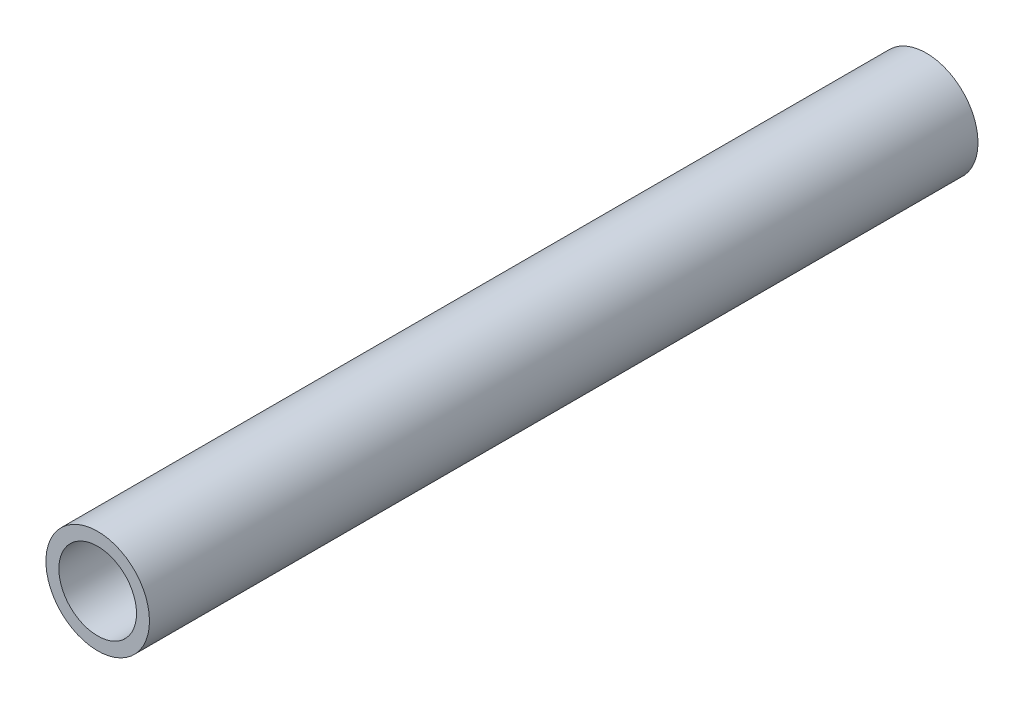
ISO-10303-21;
HEADER;
FILE_DESCRIPTION(('STEP AP214'),'2;1');
FILE_NAME('part.step','',(''),(''),'','','');
FILE_SCHEMA(('AUTOMOTIVE_DESIGN { 1 0 10303 214 1 1 1 1 }'));
ENDSEC;
DATA;
#1=APPLICATION_CONTEXT('core data for automotive mechanical design processes');
#2=APPLICATION_PROTOCOL_DEFINITION('international standard','automotive_design',2000,#1);
#3=PRODUCT_CONTEXT('',#1,'mechanical');
#4=PRODUCT('Part','Part','',(#3));
#5=PRODUCT_RELATED_PRODUCT_CATEGORY('part','',(#4));
#6=PRODUCT_DEFINITION_FORMATION('','',#4);
#7=PRODUCT_DEFINITION_CONTEXT('part definition',#1,'design');
#8=PRODUCT_DEFINITION('design','',#6,#7);
#9=PRODUCT_DEFINITION_SHAPE('','',#8);
#10=(LENGTH_UNIT() NAMED_UNIT(*) SI_UNIT(.MILLI.,.METRE.));
#11=(NAMED_UNIT(*) PLANE_ANGLE_UNIT() SI_UNIT($,.RADIAN.));
#12=(NAMED_UNIT(*) SI_UNIT($,.STERADIAN.) SOLID_ANGLE_UNIT());
#13=UNCERTAINTY_MEASURE_WITH_UNIT(LENGTH_MEASURE(1.E-05),#10,'distance_accuracy_value','');
#14=(GEOMETRIC_REPRESENTATION_CONTEXT(3) GLOBAL_UNCERTAINTY_ASSIGNED_CONTEXT((#13)) GLOBAL_UNIT_ASSIGNED_CONTEXT((#10,
#11,#12)) REPRESENTATION_CONTEXT('',''));
#15=CARTESIAN_POINT('',(0.,0.,0.));
#16=DIRECTION('',(0.,0.,1.));
#17=DIRECTION('',(1.,0.,0.));
#18=AXIS2_PLACEMENT_3D('',#15,#16,#17);
#19=CARTESIAN_POINT('',(0.,0.,50.8));
#20=DIRECTION('',(0.,0.,1.));
#21=DIRECTION('',(1.,0.,0.));
#22=AXIS2_PLACEMENT_3D('',#19,#20,#21);
#23=PLANE('',#22);
#24=CARTESIAN_POINT('',(0.,0.,50.8));
#25=DIRECTION('',(0.,0.,1.));
#26=DIRECTION('',(1.,0.,0.));
#27=AXIS2_PLACEMENT_3D('',#24,#25,#26);
#28=CIRCLE('',#27,3.175);
#29=CARTESIAN_POINT('',(3.175,0.,50.8));
#30=VERTEX_POINT('',#29);
#31=EDGE_CURVE('E10',#30,#30,#28,.T.);
#32=ORIENTED_EDGE('',*,*,#31,.T.);
#33=EDGE_LOOP('',(#32));
#34=FACE_BOUND('',#33,.T.);
#35=CARTESIAN_POINT('',(0.,0.,50.8));
#36=DIRECTION('',(0.,0.,1.));
#37=DIRECTION('',(1.,0.,0.));
#38=AXIS2_PLACEMENT_3D('',#35,#36,#37);
#39=CIRCLE('',#38,2.38125);
#40=CARTESIAN_POINT('',(2.38125,0.,50.8));
#41=VERTEX_POINT('',#40);
#42=EDGE_CURVE('E42',#41,#41,#39,.T.);
#43=ORIENTED_EDGE('',*,*,#42,.F.);
#44=EDGE_LOOP('',(#43));
#45=FACE_BOUND('',#44,.T.);
#46=ADVANCED_FACE('F31',(#34,#45),#23,.T.);
#47=CARTESIAN_POINT('',(0.,0.,0.));
#48=DIRECTION('',(0.,0.,1.));
#49=DIRECTION('',(1.,0.,0.));
#50=AXIS2_PLACEMENT_3D('',#47,#48,#49);
#51=PLANE('',#50);
#52=CARTESIAN_POINT('',(0.,0.,0.));
#53=DIRECTION('',(0.,0.,1.));
#54=DIRECTION('',(1.,0.,0.));
#55=AXIS2_PLACEMENT_3D('',#52,#53,#54);
#56=CIRCLE('',#55,3.175);
#57=CARTESIAN_POINT('',(3.175,0.,0.));
#58=VERTEX_POINT('',#57);
#59=EDGE_CURVE('E35',#58,#58,#56,.T.);
#60=ORIENTED_EDGE('',*,*,#59,.F.);
#61=EDGE_LOOP('',(#60));
#62=FACE_BOUND('',#61,.T.);
#63=CARTESIAN_POINT('',(0.,0.,0.));
#64=DIRECTION('',(0.,0.,1.));
#65=DIRECTION('',(1.,0.,0.));
#66=AXIS2_PLACEMENT_3D('',#63,#64,#65);
#67=CIRCLE('',#66,2.38125);
#68=CARTESIAN_POINT('',(2.38125,0.,0.));
#69=VERTEX_POINT('',#68);
#70=EDGE_CURVE('E44',#69,#69,#67,.T.);
#71=ORIENTED_EDGE('',*,*,#70,.T.);
#72=EDGE_LOOP('',(#71));
#73=FACE_BOUND('',#72,.T.);
#74=ADVANCED_FACE('F54',(#62,#73),#51,.F.);
#75=CARTESIAN_POINT('',(0.,0.,50.8));
#76=DIRECTION('',(0.,0.,-1.));
#77=DIRECTION('',(-1.,0.,0.));
#78=AXIS2_PLACEMENT_3D('',#75,#76,#77);
#79=CYLINDRICAL_SURFACE('',#78,3.175);
#80=ORIENTED_EDGE('',*,*,#31,.F.);
#81=EDGE_LOOP('',(#80));
#82=FACE_BOUND('',#81,.T.);
#83=ORIENTED_EDGE('',*,*,#59,.T.);
#84=EDGE_LOOP('',(#83));
#85=FACE_BOUND('',#84,.T.);
#86=ADVANCED_FACE('F33',(#82,#85),#79,.T.);
#87=CARTESIAN_POINT('',(0.,0.,50.8));
#88=DIRECTION('',(0.,0.,-1.));
#89=DIRECTION('',(-1.,0.,0.));
#90=AXIS2_PLACEMENT_3D('',#87,#88,#89);
#91=CYLINDRICAL_SURFACE('',#90,2.38125);
#92=ORIENTED_EDGE('',*,*,#42,.T.);
#93=EDGE_LOOP('',(#92));
#94=FACE_BOUND('',#93,.T.);
#95=ORIENTED_EDGE('',*,*,#70,.F.);
#96=EDGE_LOOP('',(#95));
#97=FACE_BOUND('',#96,.T.);
#98=ADVANCED_FACE('F50',(#94,#97),#91,.F.);
#99=CLOSED_SHELL('',(#46,#74,#86,#98));
#100=MANIFOLD_SOLID_BREP('B2',#99);
#101=ADVANCED_BREP_SHAPE_REPRESENTATION('',(#18,#100),#14);
#102=SHAPE_DEFINITION_REPRESENTATION(#9,#101);
ENDSEC;
END-ISO-10303-21;
